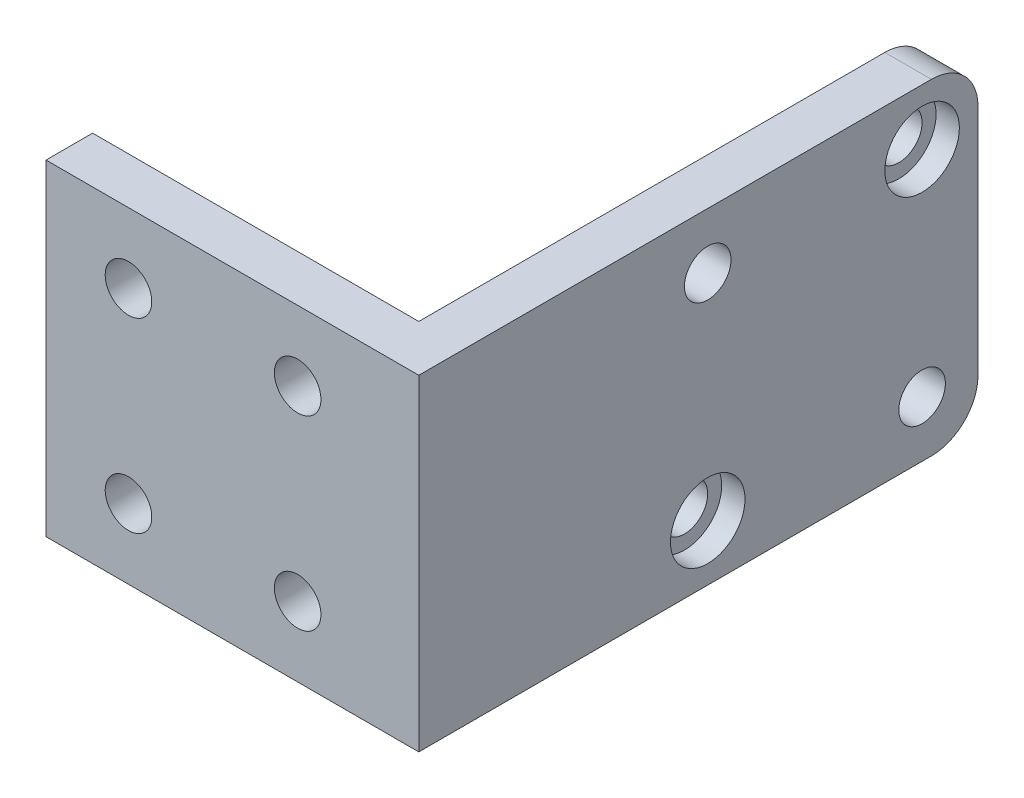
ISO-10303-21;
HEADER;
FILE_DESCRIPTION(('STEP AP214'),'2;1');
FILE_NAME('part.step','',(''),(''),'','','');
FILE_SCHEMA(('AUTOMOTIVE_DESIGN { 1 0 10303 214 1 1 1 1 }'));
ENDSEC;
DATA;
#1=APPLICATION_CONTEXT('core data for automotive mechanical design processes');
#2=APPLICATION_PROTOCOL_DEFINITION('international standard','automotive_design',2000,#1);
#3=PRODUCT_CONTEXT('',#1,'mechanical');
#4=PRODUCT('Part','Part','',(#3));
#5=PRODUCT_RELATED_PRODUCT_CATEGORY('part','',(#4));
#6=PRODUCT_DEFINITION_FORMATION('','',#4);
#7=PRODUCT_DEFINITION_CONTEXT('part definition',#1,'design');
#8=PRODUCT_DEFINITION('design','',#6,#7);
#9=PRODUCT_DEFINITION_SHAPE('','',#8);
#10=(LENGTH_UNIT() NAMED_UNIT(*) SI_UNIT(.MILLI.,.METRE.));
#11=(NAMED_UNIT(*) PLANE_ANGLE_UNIT() SI_UNIT($,.RADIAN.));
#12=(NAMED_UNIT(*) SI_UNIT($,.STERADIAN.) SOLID_ANGLE_UNIT());
#13=UNCERTAINTY_MEASURE_WITH_UNIT(LENGTH_MEASURE(1.E-05),#10,'distance_accuracy_value','');
#14=(GEOMETRIC_REPRESENTATION_CONTEXT(3) GLOBAL_UNCERTAINTY_ASSIGNED_CONTEXT((#13)) GLOBAL_UNIT_ASSIGNED_CONTEXT((#10,
#11,#12)) REPRESENTATION_CONTEXT('',''));
#15=CARTESIAN_POINT('',(0.,0.,0.));
#16=DIRECTION('',(0.,0.,1.));
#17=DIRECTION('',(1.,0.,0.));
#18=AXIS2_PLACEMENT_3D('',#15,#16,#17);
#19=CARTESIAN_POINT('',(40.,29.,-54.));
#20=DIRECTION('',(-1.,0.,0.));
#21=DIRECTION('',(0.,0.,1.));
#22=AXIS2_PLACEMENT_3D('',#19,#20,#21);
#23=CYLINDRICAL_SURFACE('',#22,2.5);
#24=CARTESIAN_POINT('',(35.,29.,-54.));
#25=DIRECTION('',(-1.,0.,0.));
#26=DIRECTION('',(0.,0.,1.));
#27=AXIS2_PLACEMENT_3D('',#24,#25,#26);
#28=CIRCLE('',#27,2.5);
#29=CARTESIAN_POINT('',(35.,29.,-51.5));
#30=VERTEX_POINT('',#29);
#31=EDGE_CURVE('E175',#30,#30,#28,.T.);
#32=ORIENTED_EDGE('',*,*,#31,.T.);
#33=EDGE_LOOP('',(#32));
#34=FACE_BOUND('',#33,.T.);
#35=CARTESIAN_POINT('',(37.5,29.,-54.));
#36=DIRECTION('',(1.,0.,0.));
#37=DIRECTION('',(0.,0.,-1.));
#38=AXIS2_PLACEMENT_3D('',#35,#36,#37);
#39=CIRCLE('',#38,2.5);
#40=CARTESIAN_POINT('',(37.5,29.,-56.5));
#41=VERTEX_POINT('',#40);
#42=EDGE_CURVE('E43',#41,#41,#39,.F.);
#43=ORIENTED_EDGE('',*,*,#42,.F.);
#44=EDGE_LOOP('',(#43));
#45=FACE_BOUND('',#44,.T.);
#46=ADVANCED_FACE('F39',(#34,#45),#23,.F.);
#47=CARTESIAN_POINT('',(40.,6.,-31.));
#48=DIRECTION('',(-1.,0.,0.));
#49=DIRECTION('',(0.,0.,1.));
#50=AXIS2_PLACEMENT_3D('',#47,#48,#49);
#51=CYLINDRICAL_SURFACE('',#50,2.5);
#52=CARTESIAN_POINT('',(35.,6.,-31.));
#53=DIRECTION('',(-1.,0.,0.));
#54=DIRECTION('',(0.,0.,1.));
#55=AXIS2_PLACEMENT_3D('',#52,#53,#54);
#56=CIRCLE('',#55,2.5);
#57=CARTESIAN_POINT('',(35.,6.,-28.5));
#58=VERTEX_POINT('',#57);
#59=EDGE_CURVE('E153',#58,#58,#56,.T.);
#60=ORIENTED_EDGE('',*,*,#59,.T.);
#61=EDGE_LOOP('',(#60));
#62=FACE_BOUND('',#61,.T.);
#63=CARTESIAN_POINT('',(37.5,6.,-31.));
#64=DIRECTION('',(1.,0.,0.));
#65=DIRECTION('',(0.,0.,-1.));
#66=AXIS2_PLACEMENT_3D('',#63,#64,#65);
#67=CIRCLE('',#66,2.5);
#68=CARTESIAN_POINT('',(37.5,6.,-33.5));
#69=VERTEX_POINT('',#68);
#70=EDGE_CURVE('E147',#69,#69,#67,.F.);
#71=ORIENTED_EDGE('',*,*,#70,.F.);
#72=EDGE_LOOP('',(#71));
#73=FACE_BOUND('',#72,.T.);
#74=ADVANCED_FACE('F260',(#62,#73),#51,.F.);
#75=CARTESIAN_POINT('',(40.,35.,0.));
#76=DIRECTION('',(0.,0.,-1.));
#77=DIRECTION('',(-1.,0.,0.));
#78=AXIS2_PLACEMENT_3D('',#75,#76,#77);
#79=PLANE('',#78);
#80=CARTESIAN_POINT('',(8.85118861959898,27.5,0.));
#81=DIRECTION('',(0.,0.,-1.));
#82=DIRECTION('',(-1.,0.,0.));
#83=AXIS2_PLACEMENT_3D('',#80,#81,#82);
#84=CIRCLE('',#83,2.5);
#85=CARTESIAN_POINT('',(6.35118861959898,27.5,0.));
#86=VERTEX_POINT('',#85);
#87=EDGE_CURVE('E196',#86,#86,#84,.T.);
#88=ORIENTED_EDGE('',*,*,#87,.T.);
#89=EDGE_LOOP('',(#88));
#90=FACE_BOUND('',#89,.T.);
#91=CARTESIAN_POINT('',(27.0004164481588,7.5,0.));
#92=DIRECTION('',(0.,0.,-1.));
#93=DIRECTION('',(-1.,0.,0.));
#94=AXIS2_PLACEMENT_3D('',#91,#92,#93);
#95=CIRCLE('',#94,2.5);
#96=CARTESIAN_POINT('',(24.5004164481588,7.5,0.));
#97=VERTEX_POINT('',#96);
#98=EDGE_CURVE('E189',#97,#97,#95,.T.);
#99=ORIENTED_EDGE('',*,*,#98,.T.);
#100=EDGE_LOOP('',(#99));
#101=FACE_BOUND('',#100,.T.);
#102=CARTESIAN_POINT('',(8.85118861959898,7.5,0.));
#103=DIRECTION('',(0.,0.,-1.));
#104=DIRECTION('',(-1.,0.,0.));
#105=AXIS2_PLACEMENT_3D('',#102,#103,#104);
#106=CIRCLE('',#105,2.5);
#107=CARTESIAN_POINT('',(6.35118861959898,7.5,0.));
#108=VERTEX_POINT('',#107);
#109=EDGE_CURVE('E183',#108,#108,#106,.T.);
#110=ORIENTED_EDGE('',*,*,#109,.T.);
#111=EDGE_LOOP('',(#110));
#112=FACE_BOUND('',#111,.T.);
#113=CARTESIAN_POINT('',(27.0004164481588,27.5,0.));
#114=DIRECTION('',(0.,0.,-1.));
#115=DIRECTION('',(-1.,0.,0.));
#116=AXIS2_PLACEMENT_3D('',#113,#114,#115);
#117=CIRCLE('',#116,2.5);
#118=CARTESIAN_POINT('',(24.5004164481588,27.5,0.));
#119=VERTEX_POINT('',#118);
#120=EDGE_CURVE('E204',#119,#119,#117,.T.);
#121=ORIENTED_EDGE('',*,*,#120,.T.);
#122=EDGE_LOOP('',(#121));
#123=FACE_BOUND('',#122,.T.);
#124=DIRECTION('',(1.,0.,0.));
#125=VECTOR('',#124,1.);
#126=CARTESIAN_POINT('',(40.,0.,0.));
#127=LINE('',#126,#125);
#128=CARTESIAN_POINT('',(0.,0.,0.));
#129=VERTEX_POINT('',#128);
#130=CARTESIAN_POINT('',(40.,0.,0.));
#131=VERTEX_POINT('',#130);
#132=EDGE_CURVE('E128',#129,#131,#127,.T.);
#133=ORIENTED_EDGE('',*,*,#132,.T.);
#134=DIRECTION('',(0.,-1.,0.));
#135=VECTOR('',#134,1.);
#136=CARTESIAN_POINT('',(40.,35.,0.));
#137=LINE('',#136,#135);
#138=CARTESIAN_POINT('',(40.,35.,0.));
#139=VERTEX_POINT('',#138);
#140=EDGE_CURVE('E110',#139,#131,#137,.T.);
#141=ORIENTED_EDGE('',*,*,#140,.F.);
#142=DIRECTION('',(1.,0.,0.));
#143=VECTOR('',#142,1.);
#144=CARTESIAN_POINT('',(40.,35.,0.));
#145=LINE('',#144,#143);
#146=CARTESIAN_POINT('',(0.,35.,0.));
#147=VERTEX_POINT('',#146);
#148=EDGE_CURVE('E115',#147,#139,#145,.T.);
#149=ORIENTED_EDGE('',*,*,#148,.F.);
#150=DIRECTION('',(0.,-1.,0.));
#151=VECTOR('',#150,1.);
#152=CARTESIAN_POINT('',(0.,35.,0.));
#153=LINE('',#152,#151);
#154=EDGE_CURVE('E213',#147,#129,#153,.T.);
#155=ORIENTED_EDGE('',*,*,#154,.T.);
#156=EDGE_LOOP('',(#133,#141,#149,#155));
#157=FACE_BOUND('',#156,.T.);
#158=ADVANCED_FACE('F126',(#90,#101,#112,#123,#157),#79,.F.);
#159=CARTESIAN_POINT('',(40.,35.,-60.));
#160=DIRECTION('',(-1.,0.,0.));
#161=DIRECTION('',(0.,0.,1.));
#162=AXIS2_PLACEMENT_3D('',#159,#160,#161);
#163=PLANE('',#162);
#164=CARTESIAN_POINT('',(40.,29.,-54.));
#165=DIRECTION('',(1.,0.,0.));
#166=DIRECTION('',(0.,0.,-1.));
#167=AXIS2_PLACEMENT_3D('',#164,#165,#166);
#168=CIRCLE('',#167,4.);
#169=CARTESIAN_POINT('',(40.,29.,-58.));
#170=VERTEX_POINT('',#169);
#171=EDGE_CURVE('E155',#170,#170,#168,.T.);
#172=ORIENTED_EDGE('',*,*,#171,.F.);
#173=EDGE_LOOP('',(#172));
#174=FACE_BOUND('',#173,.T.);
#175=CARTESIAN_POINT('',(40.,6.,-31.));
#176=DIRECTION('',(1.,0.,0.));
#177=DIRECTION('',(0.,0.,-1.));
#178=AXIS2_PLACEMENT_3D('',#175,#176,#177);
#179=CIRCLE('',#178,4.);
#180=CARTESIAN_POINT('',(40.,6.,-35.));
#181=VERTEX_POINT('',#180);
#182=EDGE_CURVE('E160',#181,#181,#179,.T.);
#183=ORIENTED_EDGE('',*,*,#182,.F.);
#184=EDGE_LOOP('',(#183));
#185=FACE_BOUND('',#184,.T.);
#186=CARTESIAN_POINT('',(40.,6.,-54.));
#187=DIRECTION('',(-1.,0.,0.));
#188=DIRECTION('',(0.,0.,1.));
#189=AXIS2_PLACEMENT_3D('',#186,#187,#188);
#190=CIRCLE('',#189,2.5);
#191=CARTESIAN_POINT('',(40.,6.,-51.5));
#192=VERTEX_POINT('',#191);
#193=EDGE_CURVE('E172',#192,#192,#190,.T.);
#194=ORIENTED_EDGE('',*,*,#193,.T.);
#195=EDGE_LOOP('',(#194));
#196=FACE_BOUND('',#195,.T.);
#197=CARTESIAN_POINT('',(40.,29.,-31.));
#198=DIRECTION('',(-1.,0.,0.));
#199=DIRECTION('',(0.,0.,1.));
#200=AXIS2_PLACEMENT_3D('',#197,#198,#199);
#201=CIRCLE('',#200,2.5);
#202=CARTESIAN_POINT('',(40.,29.,-28.5));
#203=VERTEX_POINT('',#202);
#204=EDGE_CURVE('E180',#203,#203,#201,.T.);
#205=ORIENTED_EDGE('',*,*,#204,.T.);
#206=EDGE_LOOP('',(#205));
#207=FACE_BOUND('',#206,.T.);
#208=DIRECTION('',(0.,0.,-1.));
#209=VECTOR('',#208,1.);
#210=CARTESIAN_POINT('',(40.,0.,-60.));
#211=LINE('',#210,#209);
#212=CARTESIAN_POINT('',(40.,0.,-55.));
#213=VERTEX_POINT('',#212);
#214=EDGE_CURVE('E215',#131,#213,#211,.T.);
#215=ORIENTED_EDGE('',*,*,#214,.T.);
#216=CARTESIAN_POINT('',(40.,5.,-55.));
#217=DIRECTION('',(-1.,0.,0.));
#218=DIRECTION('',(0.,0.,1.));
#219=AXIS2_PLACEMENT_3D('',#216,#217,#218);
#220=CIRCLE('',#219,5.);
#221=CARTESIAN_POINT('',(40.,5.,-60.));
#222=VERTEX_POINT('',#221);
#223=EDGE_CURVE('E48',#213,#222,#220,.F.);
#224=ORIENTED_EDGE('',*,*,#223,.T.);
#225=DIRECTION('',(0.,-1.,0.));
#226=VECTOR('',#225,1.);
#227=CARTESIAN_POINT('',(40.,35.,-60.));
#228=LINE('',#227,#226);
#229=CARTESIAN_POINT('',(40.,30.,-60.));
#230=VERTEX_POINT('',#229);
#231=EDGE_CURVE('E130',#230,#222,#228,.T.);
#232=ORIENTED_EDGE('',*,*,#231,.F.);
#233=CARTESIAN_POINT('',(40.,30.,-55.));
#234=DIRECTION('',(-1.,0.,0.));
#235=DIRECTION('',(0.,0.,1.));
#236=AXIS2_PLACEMENT_3D('',#233,#234,#235);
#237=CIRCLE('',#236,5.);
#238=CARTESIAN_POINT('',(40.,35.,-55.));
#239=VERTEX_POINT('',#238);
#240=EDGE_CURVE('E56',#230,#239,#237,.F.);
#241=ORIENTED_EDGE('',*,*,#240,.T.);
#242=DIRECTION('',(0.,0.,-1.));
#243=VECTOR('',#242,1.);
#244=CARTESIAN_POINT('',(40.,35.,-60.));
#245=LINE('',#244,#243);
#246=EDGE_CURVE('E106',#139,#239,#245,.T.);
#247=ORIENTED_EDGE('',*,*,#246,.F.);
#248=ORIENTED_EDGE('',*,*,#140,.T.);
#249=EDGE_LOOP('',(#215,#224,#232,#241,#247,#248));
#250=FACE_BOUND('',#249,.T.);
#251=ADVANCED_FACE('F108',(#174,#185,#196,#207,#250),#163,.F.);
#252=CARTESIAN_POINT('',(35.,35.,-60.));
#253=DIRECTION('',(0.,0.,1.));
#254=DIRECTION('',(1.,0.,0.));
#255=AXIS2_PLACEMENT_3D('',#252,#253,#254);
#256=PLANE('',#255);
#257=ORIENTED_EDGE('',*,*,#231,.T.);
#258=DIRECTION('',(-1.,0.,0.));
#259=VECTOR('',#258,1.);
#260=CARTESIAN_POINT('',(35.,5.,-60.));
#261=LINE('',#260,#259);
#262=CARTESIAN_POINT('',(35.,5.,-60.));
#263=VERTEX_POINT('',#262);
#264=EDGE_CURVE('E132',#222,#263,#261,.T.);
#265=ORIENTED_EDGE('',*,*,#264,.T.);
#266=DIRECTION('',(0.,-1.,0.));
#267=VECTOR('',#266,1.);
#268=CARTESIAN_POINT('',(35.,35.,-60.));
#269=LINE('',#268,#267);
#270=CARTESIAN_POINT('',(35.,30.,-60.));
#271=VERTEX_POINT('',#270);
#272=EDGE_CURVE('E135',#271,#263,#269,.T.);
#273=ORIENTED_EDGE('',*,*,#272,.F.);
#274=DIRECTION('',(-1.,0.,0.));
#275=VECTOR('',#274,1.);
#276=CARTESIAN_POINT('',(35.,30.,-60.));
#277=LINE('',#276,#275);
#278=EDGE_CURVE('E129',#271,#230,#277,.F.);
#279=ORIENTED_EDGE('',*,*,#278,.T.);
#280=EDGE_LOOP('',(#257,#265,#273,#279));
#281=FACE_BOUND('',#280,.T.);
#282=ADVANCED_FACE('F235',(#281),#256,.F.);
#283=CARTESIAN_POINT('',(35.,35.,-5.));
#284=DIRECTION('',(1.,0.,0.));
#285=DIRECTION('',(0.,0.,-1.));
#286=AXIS2_PLACEMENT_3D('',#283,#284,#285);
#287=PLANE('',#286);
#288=ORIENTED_EDGE('',*,*,#59,.F.);
#289=EDGE_LOOP('',(#288));
#290=FACE_BOUND('',#289,.T.);
#291=ORIENTED_EDGE('',*,*,#31,.F.);
#292=EDGE_LOOP('',(#291));
#293=FACE_BOUND('',#292,.T.);
#294=CARTESIAN_POINT('',(35.,6.,-54.));
#295=DIRECTION('',(-1.,0.,0.));
#296=DIRECTION('',(0.,0.,1.));
#297=AXIS2_PLACEMENT_3D('',#294,#295,#296);
#298=CIRCLE('',#297,2.5);
#299=CARTESIAN_POINT('',(35.,6.,-51.5));
#300=VERTEX_POINT('',#299);
#301=EDGE_CURVE('E168',#300,#300,#298,.T.);
#302=ORIENTED_EDGE('',*,*,#301,.F.);
#303=EDGE_LOOP('',(#302));
#304=FACE_BOUND('',#303,.T.);
#305=CARTESIAN_POINT('',(35.,29.,-31.));
#306=DIRECTION('',(-1.,0.,0.));
#307=DIRECTION('',(0.,0.,1.));
#308=AXIS2_PLACEMENT_3D('',#305,#306,#307);
#309=CIRCLE('',#308,2.5);
#310=CARTESIAN_POINT('',(35.,29.,-28.5));
#311=VERTEX_POINT('',#310);
#312=EDGE_CURVE('E171',#311,#311,#309,.T.);
#313=ORIENTED_EDGE('',*,*,#312,.F.);
#314=EDGE_LOOP('',(#313));
#315=FACE_BOUND('',#314,.T.);
#316=ORIENTED_EDGE('',*,*,#272,.T.);
#317=CARTESIAN_POINT('',(35.,5.,-55.));
#318=DIRECTION('',(1.,0.,0.));
#319=DIRECTION('',(0.,0.,-1.));
#320=AXIS2_PLACEMENT_3D('',#317,#318,#319);
#321=CIRCLE('',#320,5.);
#322=CARTESIAN_POINT('',(35.,0.,-55.));
#323=VERTEX_POINT('',#322);
#324=EDGE_CURVE('E143',#263,#323,#321,.F.);
#325=ORIENTED_EDGE('',*,*,#324,.T.);
#326=DIRECTION('',(0.,0.,1.));
#327=VECTOR('',#326,1.);
#328=CARTESIAN_POINT('',(35.,0.,-5.));
#329=LINE('',#328,#327);
#330=CARTESIAN_POINT('',(35.,0.,-5.));
#331=VERTEX_POINT('',#330);
#332=EDGE_CURVE('E217',#323,#331,#329,.T.);
#333=ORIENTED_EDGE('',*,*,#332,.T.);
#334=DIRECTION('',(0.,-1.,0.));
#335=VECTOR('',#334,1.);
#336=CARTESIAN_POINT('',(35.,35.,-5.));
#337=LINE('',#336,#335);
#338=CARTESIAN_POINT('',(35.,35.,-5.));
#339=VERTEX_POINT('',#338);
#340=EDGE_CURVE('E226',#339,#331,#337,.T.);
#341=ORIENTED_EDGE('',*,*,#340,.F.);
#342=DIRECTION('',(0.,0.,1.));
#343=VECTOR('',#342,1.);
#344=CARTESIAN_POINT('',(35.,35.,-5.));
#345=LINE('',#344,#343);
#346=CARTESIAN_POINT('',(35.,35.,-55.));
#347=VERTEX_POINT('',#346);
#348=EDGE_CURVE('E114',#347,#339,#345,.T.);
#349=ORIENTED_EDGE('',*,*,#348,.F.);
#350=CARTESIAN_POINT('',(35.,30.,-55.));
#351=DIRECTION('',(1.,0.,0.));
#352=DIRECTION('',(0.,0.,-1.));
#353=AXIS2_PLACEMENT_3D('',#350,#351,#352);
#354=CIRCLE('',#353,5.);
#355=EDGE_CURVE('E141',#347,#271,#354,.F.);
#356=ORIENTED_EDGE('',*,*,#355,.T.);
#357=EDGE_LOOP('',(#316,#325,#333,#341,#349,#356));
#358=FACE_BOUND('',#357,.T.);
#359=ADVANCED_FACE('F231',(#290,#293,#304,#315,#358),#287,.F.);
#360=CARTESIAN_POINT('',(0.,35.,-5.));
#361=DIRECTION('',(0.,0.,1.));
#362=DIRECTION('',(1.,0.,0.));
#363=AXIS2_PLACEMENT_3D('',#360,#361,#362);
#364=PLANE('',#363);
#365=CARTESIAN_POINT('',(8.85118861959898,27.5,-5.));
#366=DIRECTION('',(0.,0.,-1.));
#367=DIRECTION('',(-1.,0.,0.));
#368=AXIS2_PLACEMENT_3D('',#365,#366,#367);
#369=CIRCLE('',#368,2.5);
#370=CARTESIAN_POINT('',(6.35118861959898,27.5,-5.));
#371=VERTEX_POINT('',#370);
#372=EDGE_CURVE('E192',#371,#371,#369,.T.);
#373=ORIENTED_EDGE('',*,*,#372,.F.);
#374=EDGE_LOOP('',(#373));
#375=FACE_BOUND('',#374,.T.);
#376=CARTESIAN_POINT('',(27.0004164481588,7.5,-5.));
#377=DIRECTION('',(0.,0.,-1.));
#378=DIRECTION('',(-1.,0.,0.));
#379=AXIS2_PLACEMENT_3D('',#376,#377,#378);
#380=CIRCLE('',#379,2.5);
#381=CARTESIAN_POINT('',(24.5004164481588,7.5,-5.));
#382=VERTEX_POINT('',#381);
#383=EDGE_CURVE('E199',#382,#382,#380,.T.);
#384=ORIENTED_EDGE('',*,*,#383,.F.);
#385=EDGE_LOOP('',(#384));
#386=FACE_BOUND('',#385,.T.);
#387=CARTESIAN_POINT('',(8.85118861959898,7.5,-5.));
#388=DIRECTION('',(0.,0.,-1.));
#389=DIRECTION('',(-1.,0.,0.));
#390=AXIS2_PLACEMENT_3D('',#387,#388,#389);
#391=CIRCLE('',#390,2.5);
#392=CARTESIAN_POINT('',(6.35118861959898,7.5,-5.));
#393=VERTEX_POINT('',#392);
#394=EDGE_CURVE('E186',#393,#393,#391,.T.);
#395=ORIENTED_EDGE('',*,*,#394,.F.);
#396=EDGE_LOOP('',(#395));
#397=FACE_BOUND('',#396,.T.);
#398=CARTESIAN_POINT('',(27.0004164481588,27.5,-5.));
#399=DIRECTION('',(0.,0.,-1.));
#400=DIRECTION('',(-1.,0.,0.));
#401=AXIS2_PLACEMENT_3D('',#398,#399,#400);
#402=CIRCLE('',#401,2.5);
#403=CARTESIAN_POINT('',(24.5004164481588,27.5,-5.));
#404=VERTEX_POINT('',#403);
#405=EDGE_CURVE('E195',#404,#404,#402,.T.);
#406=ORIENTED_EDGE('',*,*,#405,.F.);
#407=EDGE_LOOP('',(#406));
#408=FACE_BOUND('',#407,.T.);
#409=DIRECTION('',(-1.,0.,0.));
#410=VECTOR('',#409,1.);
#411=CARTESIAN_POINT('',(0.,0.,-5.));
#412=LINE('',#411,#410);
#413=CARTESIAN_POINT('',(0.,0.,-5.));
#414=VERTEX_POINT('',#413);
#415=EDGE_CURVE('E219',#331,#414,#412,.T.);
#416=ORIENTED_EDGE('',*,*,#415,.T.);
#417=DIRECTION('',(0.,-1.,0.));
#418=VECTOR('',#417,1.);
#419=CARTESIAN_POINT('',(0.,35.,-5.));
#420=LINE('',#419,#418);
#421=CARTESIAN_POINT('',(0.,35.,-5.));
#422=VERTEX_POINT('',#421);
#423=EDGE_CURVE('E223',#422,#414,#420,.T.);
#424=ORIENTED_EDGE('',*,*,#423,.F.);
#425=DIRECTION('',(-1.,0.,0.));
#426=VECTOR('',#425,1.);
#427=CARTESIAN_POINT('',(0.,35.,-5.));
#428=LINE('',#427,#426);
#429=EDGE_CURVE('E210',#339,#422,#428,.T.);
#430=ORIENTED_EDGE('',*,*,#429,.F.);
#431=ORIENTED_EDGE('',*,*,#340,.T.);
#432=EDGE_LOOP('',(#416,#424,#430,#431));
#433=FACE_BOUND('',#432,.T.);
#434=ADVANCED_FACE('F243',(#375,#386,#397,#408,#433),#364,.F.);
#435=CARTESIAN_POINT('',(0.,35.,0.));
#436=DIRECTION('',(1.,0.,0.));
#437=DIRECTION('',(0.,0.,-1.));
#438=AXIS2_PLACEMENT_3D('',#435,#436,#437);
#439=PLANE('',#438);
#440=DIRECTION('',(0.,0.,1.));
#441=VECTOR('',#440,1.);
#442=CARTESIAN_POINT('',(0.,0.,0.));
#443=LINE('',#442,#441);
#444=EDGE_CURVE('E124',#414,#129,#443,.T.);
#445=ORIENTED_EDGE('',*,*,#444,.T.);
#446=ORIENTED_EDGE('',*,*,#154,.F.);
#447=DIRECTION('',(0.,0.,1.));
#448=VECTOR('',#447,1.);
#449=CARTESIAN_POINT('',(0.,35.,0.));
#450=LINE('',#449,#448);
#451=EDGE_CURVE('E120',#422,#147,#450,.T.);
#452=ORIENTED_EDGE('',*,*,#451,.F.);
#453=ORIENTED_EDGE('',*,*,#423,.T.);
#454=EDGE_LOOP('',(#445,#446,#452,#453));
#455=FACE_BOUND('',#454,.T.);
#456=ADVANCED_FACE('F246',(#455),#439,.F.);
#457=CARTESIAN_POINT('',(0.,35.,0.));
#458=DIRECTION('',(0.,-1.,0.));
#459=DIRECTION('',(0.,0.,-1.));
#460=AXIS2_PLACEMENT_3D('',#457,#458,#459);
#461=PLANE('',#460);
#462=ORIENTED_EDGE('',*,*,#246,.T.);
#463=DIRECTION('',(-1.,0.,0.));
#464=VECTOR('',#463,1.);
#465=CARTESIAN_POINT('',(0.,35.,-55.));
#466=LINE('',#465,#464);
#467=EDGE_CURVE('E11',#239,#347,#466,.T.);
#468=ORIENTED_EDGE('',*,*,#467,.T.);
#469=ORIENTED_EDGE('',*,*,#348,.T.);
#470=ORIENTED_EDGE('',*,*,#429,.T.);
#471=ORIENTED_EDGE('',*,*,#451,.T.);
#472=ORIENTED_EDGE('',*,*,#148,.T.);
#473=EDGE_LOOP('',(#462,#468,#469,#470,#471,#472));
#474=FACE_BOUND('',#473,.T.);
#475=ADVANCED_FACE('F118',(#474),#461,.F.);
#476=CARTESIAN_POINT('',(0.,0.,0.));
#477=DIRECTION('',(0.,-1.,0.));
#478=DIRECTION('',(0.,0.,-1.));
#479=AXIS2_PLACEMENT_3D('',#476,#477,#478);
#480=PLANE('',#479);
#481=ORIENTED_EDGE('',*,*,#332,.F.);
#482=DIRECTION('',(-1.,0.,0.));
#483=VECTOR('',#482,1.);
#484=CARTESIAN_POINT('',(40.,0.,-55.));
#485=LINE('',#484,#483);
#486=EDGE_CURVE('E64',#323,#213,#485,.F.);
#487=ORIENTED_EDGE('',*,*,#486,.T.);
#488=ORIENTED_EDGE('',*,*,#214,.F.);
#489=ORIENTED_EDGE('',*,*,#132,.F.);
#490=ORIENTED_EDGE('',*,*,#444,.F.);
#491=ORIENTED_EDGE('',*,*,#415,.F.);
#492=EDGE_LOOP('',(#481,#487,#488,#489,#490,#491));
#493=FACE_BOUND('',#492,.T.);
#494=ADVANCED_FACE('F247',(#493),#480,.T.);
#495=CARTESIAN_POINT('',(35.,5.,-55.));
#496=DIRECTION('',(1.,0.,0.));
#497=DIRECTION('',(0.,0.,-1.));
#498=AXIS2_PLACEMENT_3D('',#495,#496,#497);
#499=CYLINDRICAL_SURFACE('',#498,5.);
#500=ORIENTED_EDGE('',*,*,#223,.F.);
#501=ORIENTED_EDGE('',*,*,#486,.F.);
#502=ORIENTED_EDGE('',*,*,#324,.F.);
#503=ORIENTED_EDGE('',*,*,#264,.F.);
#504=EDGE_LOOP('',(#500,#501,#502,#503));
#505=FACE_BOUND('',#504,.T.);
#506=ADVANCED_FACE('F250',(#505),#499,.T.);
#507=CARTESIAN_POINT('',(0.,30.,-55.));
#508=DIRECTION('',(-1.,0.,0.));
#509=DIRECTION('',(0.,0.,1.));
#510=AXIS2_PLACEMENT_3D('',#507,#508,#509);
#511=CYLINDRICAL_SURFACE('',#510,5.);
#512=ORIENTED_EDGE('',*,*,#240,.F.);
#513=ORIENTED_EDGE('',*,*,#278,.F.);
#514=ORIENTED_EDGE('',*,*,#355,.F.);
#515=ORIENTED_EDGE('',*,*,#467,.F.);
#516=EDGE_LOOP('',(#512,#513,#514,#515));
#517=FACE_BOUND('',#516,.T.);
#518=ADVANCED_FACE('F41',(#517),#511,.T.);
#519=CARTESIAN_POINT('',(27.0004164481588,27.5,0.));
#520=DIRECTION('',(0.,0.,-1.));
#521=DIRECTION('',(-1.,0.,0.));
#522=AXIS2_PLACEMENT_3D('',#519,#520,#521);
#523=CYLINDRICAL_SURFACE('',#522,2.5);
#524=ORIENTED_EDGE('',*,*,#120,.F.);
#525=EDGE_LOOP('',(#524));
#526=FACE_BOUND('',#525,.T.);
#527=ORIENTED_EDGE('',*,*,#405,.T.);
#528=EDGE_LOOP('',(#527));
#529=FACE_BOUND('',#528,.T.);
#530=ADVANCED_FACE('F256',(#526,#529),#523,.F.);
#531=CARTESIAN_POINT('',(8.85118861959898,7.5,0.));
#532=DIRECTION('',(0.,0.,-1.));
#533=DIRECTION('',(-1.,0.,0.));
#534=AXIS2_PLACEMENT_3D('',#531,#532,#533);
#535=CYLINDRICAL_SURFACE('',#534,2.5);
#536=ORIENTED_EDGE('',*,*,#109,.F.);
#537=EDGE_LOOP('',(#536));
#538=FACE_BOUND('',#537,.T.);
#539=ORIENTED_EDGE('',*,*,#394,.T.);
#540=EDGE_LOOP('',(#539));
#541=FACE_BOUND('',#540,.T.);
#542=ADVANCED_FACE('F278',(#538,#541),#535,.F.);
#543=CARTESIAN_POINT('',(27.0004164481588,7.5,0.));
#544=DIRECTION('',(0.,0.,-1.));
#545=DIRECTION('',(-1.,0.,0.));
#546=AXIS2_PLACEMENT_3D('',#543,#544,#545);
#547=CYLINDRICAL_SURFACE('',#546,2.5);
#548=ORIENTED_EDGE('',*,*,#98,.F.);
#549=EDGE_LOOP('',(#548));
#550=FACE_BOUND('',#549,.T.);
#551=ORIENTED_EDGE('',*,*,#383,.T.);
#552=EDGE_LOOP('',(#551));
#553=FACE_BOUND('',#552,.T.);
#554=ADVANCED_FACE('F281',(#550,#553),#547,.F.);
#555=CARTESIAN_POINT('',(8.85118861959898,27.5,0.));
#556=DIRECTION('',(0.,0.,-1.));
#557=DIRECTION('',(-1.,0.,0.));
#558=AXIS2_PLACEMENT_3D('',#555,#556,#557);
#559=CYLINDRICAL_SURFACE('',#558,2.5);
#560=ORIENTED_EDGE('',*,*,#87,.F.);
#561=EDGE_LOOP('',(#560));
#562=FACE_BOUND('',#561,.T.);
#563=ORIENTED_EDGE('',*,*,#372,.T.);
#564=EDGE_LOOP('',(#563));
#565=FACE_BOUND('',#564,.T.);
#566=ADVANCED_FACE('F276',(#562,#565),#559,.F.);
#567=CARTESIAN_POINT('',(40.,29.,-31.));
#568=DIRECTION('',(-1.,0.,0.));
#569=DIRECTION('',(0.,0.,1.));
#570=AXIS2_PLACEMENT_3D('',#567,#568,#569);
#571=CYLINDRICAL_SURFACE('',#570,2.5);
#572=ORIENTED_EDGE('',*,*,#204,.F.);
#573=EDGE_LOOP('',(#572));
#574=FACE_BOUND('',#573,.T.);
#575=ORIENTED_EDGE('',*,*,#312,.T.);
#576=EDGE_LOOP('',(#575));
#577=FACE_BOUND('',#576,.T.);
#578=ADVANCED_FACE('F273',(#574,#577),#571,.F.);
#579=CARTESIAN_POINT('',(40.,6.,-54.));
#580=DIRECTION('',(-1.,0.,0.));
#581=DIRECTION('',(0.,0.,1.));
#582=AXIS2_PLACEMENT_3D('',#579,#580,#581);
#583=CYLINDRICAL_SURFACE('',#582,2.5);
#584=ORIENTED_EDGE('',*,*,#193,.F.);
#585=EDGE_LOOP('',(#584));
#586=FACE_BOUND('',#585,.T.);
#587=ORIENTED_EDGE('',*,*,#301,.T.);
#588=EDGE_LOOP('',(#587));
#589=FACE_BOUND('',#588,.T.);
#590=ADVANCED_FACE('F270',(#586,#589),#583,.F.);
#591=CARTESIAN_POINT('',(37.5,6.,-31.));
#592=DIRECTION('',(1.,0.,0.));
#593=DIRECTION('',(0.,0.,-1.));
#594=AXIS2_PLACEMENT_3D('',#591,#592,#593);
#595=PLANE('',#594);
#596=CARTESIAN_POINT('',(37.5,6.,-31.));
#597=DIRECTION('',(1.,0.,0.));
#598=DIRECTION('',(0.,0.,-1.));
#599=AXIS2_PLACEMENT_3D('',#596,#597,#598);
#600=CIRCLE('',#599,4.);
#601=CARTESIAN_POINT('',(37.5,6.,-35.));
#602=VERTEX_POINT('',#601);
#603=EDGE_CURVE('E165',#602,#602,#600,.T.);
#604=ORIENTED_EDGE('',*,*,#603,.T.);
#605=EDGE_LOOP('',(#604));
#606=FACE_BOUND('',#605,.T.);
#607=ORIENTED_EDGE('',*,*,#70,.T.);
#608=EDGE_LOOP('',(#607));
#609=FACE_BOUND('',#608,.T.);
#610=ADVANCED_FACE('F400',(#606,#609),#595,.T.);
#611=CARTESIAN_POINT('',(37.5,6.,-31.));
#612=DIRECTION('',(1.,0.,0.));
#613=DIRECTION('',(0.,0.,-1.));
#614=AXIS2_PLACEMENT_3D('',#611,#612,#613);
#615=CYLINDRICAL_SURFACE('',#614,4.);
#616=ORIENTED_EDGE('',*,*,#603,.F.);
#617=EDGE_LOOP('',(#616));
#618=FACE_BOUND('',#617,.T.);
#619=ORIENTED_EDGE('',*,*,#182,.T.);
#620=EDGE_LOOP('',(#619));
#621=FACE_BOUND('',#620,.T.);
#622=ADVANCED_FACE('F406',(#618,#621),#615,.F.);
#623=CARTESIAN_POINT('',(37.5,29.,-54.));
#624=DIRECTION('',(1.,0.,0.));
#625=DIRECTION('',(0.,0.,-1.));
#626=AXIS2_PLACEMENT_3D('',#623,#624,#625);
#627=PLANE('',#626);
#628=CARTESIAN_POINT('',(37.5,29.,-54.));
#629=DIRECTION('',(1.,0.,0.));
#630=DIRECTION('',(0.,0.,-1.));
#631=AXIS2_PLACEMENT_3D('',#628,#629,#630);
#632=CIRCLE('',#631,4.);
#633=CARTESIAN_POINT('',(37.5,29.,-58.));
#634=VERTEX_POINT('',#633);
#635=EDGE_CURVE('E149',#634,#634,#632,.T.);
#636=ORIENTED_EDGE('',*,*,#635,.T.);
#637=EDGE_LOOP('',(#636));
#638=FACE_BOUND('',#637,.T.);
#639=ORIENTED_EDGE('',*,*,#42,.T.);
#640=EDGE_LOOP('',(#639));
#641=FACE_BOUND('',#640,.T.);
#642=ADVANCED_FACE('F413',(#638,#641),#627,.T.);
#643=CARTESIAN_POINT('',(37.5,29.,-54.));
#644=DIRECTION('',(1.,0.,0.));
#645=DIRECTION('',(0.,0.,-1.));
#646=AXIS2_PLACEMENT_3D('',#643,#644,#645);
#647=CYLINDRICAL_SURFACE('',#646,4.);
#648=ORIENTED_EDGE('',*,*,#635,.F.);
#649=EDGE_LOOP('',(#648));
#650=FACE_BOUND('',#649,.T.);
#651=ORIENTED_EDGE('',*,*,#171,.T.);
#652=EDGE_LOOP('',(#651));
#653=FACE_BOUND('',#652,.T.);
#654=ADVANCED_FACE('F421',(#650,#653),#647,.F.);
#655=CLOSED_SHELL('',(#46,#74,#158,#251,#282,#359,#434,#456,#475,#494,#506,#518,#530,#542,#554,
#566,#578,#590,#610,#622,#642,#654));
#656=MANIFOLD_SOLID_BREP('B2',#655);
#657=ADVANCED_BREP_SHAPE_REPRESENTATION('',(#18,#656),#14);
#658=SHAPE_DEFINITION_REPRESENTATION(#9,#657);
ENDSEC;
END-ISO-10303-21;
